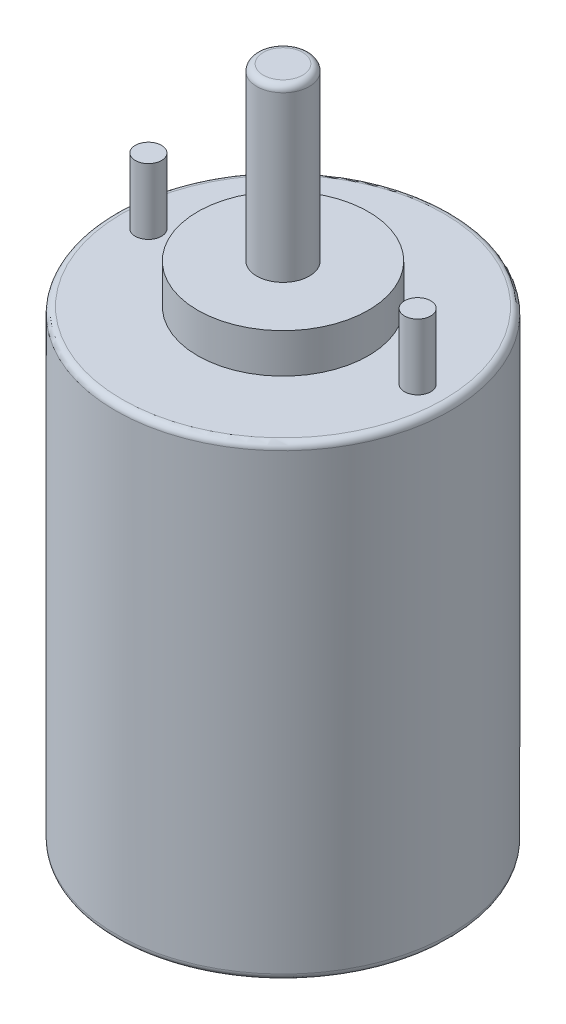
ISO-10303-21;
HEADER;
FILE_DESCRIPTION(('STEP AP214'),'2;1');
FILE_NAME('part.step','',(''),(''),'','','');
FILE_SCHEMA(('AUTOMOTIVE_DESIGN { 1 0 10303 214 1 1 1 1 }'));
ENDSEC;
DATA;
#1=APPLICATION_CONTEXT('core data for automotive mechanical design processes');
#2=APPLICATION_PROTOCOL_DEFINITION('international standard','automotive_design',2000,#1);
#3=PRODUCT_CONTEXT('',#1,'mechanical');
#4=PRODUCT('Part','Part','',(#3));
#5=PRODUCT_RELATED_PRODUCT_CATEGORY('part','',(#4));
#6=PRODUCT_DEFINITION_FORMATION('','',#4);
#7=PRODUCT_DEFINITION_CONTEXT('part definition',#1,'design');
#8=PRODUCT_DEFINITION('design','',#6,#7);
#9=PRODUCT_DEFINITION_SHAPE('','',#8);
#10=(LENGTH_UNIT() NAMED_UNIT(*) SI_UNIT(.MILLI.,.METRE.));
#11=(NAMED_UNIT(*) PLANE_ANGLE_UNIT() SI_UNIT($,.RADIAN.));
#12=(NAMED_UNIT(*) SI_UNIT($,.STERADIAN.) SOLID_ANGLE_UNIT());
#13=UNCERTAINTY_MEASURE_WITH_UNIT(LENGTH_MEASURE(1.E-05),#10,'distance_accuracy_value','');
#14=(GEOMETRIC_REPRESENTATION_CONTEXT(3) GLOBAL_UNCERTAINTY_ASSIGNED_CONTEXT((#13)) GLOBAL_UNIT_ASSIGNED_CONTEXT((#10,
#11,#12)) REPRESENTATION_CONTEXT('',''));
#15=CARTESIAN_POINT('',(0.,0.,0.));
#16=DIRECTION('',(0.,0.,1.));
#17=DIRECTION('',(1.,0.,0.));
#18=AXIS2_PLACEMENT_3D('',#15,#16,#17);
#19=CARTESIAN_POINT('',(0.,32.5,0.));
#20=DIRECTION('',(0.,-1.,0.));
#21=DIRECTION('',(0.,0.,-1.));
#22=AXIS2_PLACEMENT_3D('',#19,#20,#21);
#23=CYLINDRICAL_SURFACE('',#22,25.5);
#24=CARTESIAN_POINT('',(0.,-34.5,0.));
#25=DIRECTION('',(0.,-1.,0.));
#26=DIRECTION('',(0.,0.,-1.));
#27=AXIS2_PLACEMENT_3D('',#24,#25,#26);
#28=CIRCLE('',#27,25.5);
#29=CARTESIAN_POINT('',(0.,-34.5,-25.5));
#30=VERTEX_POINT('',#29);
#31=EDGE_CURVE('E66',#30,#30,#28,.F.);
#32=ORIENTED_EDGE('',*,*,#31,.T.);
#33=EDGE_LOOP('',(#32));
#34=FACE_BOUND('',#33,.T.);
#35=CARTESIAN_POINT('',(0.,34.5,0.));
#36=DIRECTION('',(0.,1.,0.));
#37=DIRECTION('',(0.,0.,1.));
#38=AXIS2_PLACEMENT_3D('',#35,#36,#37);
#39=CIRCLE('',#38,25.5);
#40=CARTESIAN_POINT('',(0.,34.5,25.5));
#41=VERTEX_POINT('',#40);
#42=EDGE_CURVE('E70',#41,#41,#39,.F.);
#43=ORIENTED_EDGE('',*,*,#42,.T.);
#44=EDGE_LOOP('',(#43));
#45=FACE_BOUND('',#44,.T.);
#46=ADVANCED_FACE('F38',(#34,#45),#23,.T.);
#47=CARTESIAN_POINT('',(0.,35.5,0.));
#48=DIRECTION('',(0.,1.,0.));
#49=DIRECTION('',(0.,0.,1.));
#50=AXIS2_PLACEMENT_3D('',#47,#48,#49);
#51=PLANE('',#50);
#52=CARTESIAN_POINT('',(20.5,35.5,0.));
#53=DIRECTION('',(0.,1.,0.));
#54=DIRECTION('',(0.,0.,1.));
#55=AXIS2_PLACEMENT_3D('',#52,#53,#54);
#56=CIRCLE('',#55,2.);
#57=CARTESIAN_POINT('',(20.5,35.5,2.));
#58=VERTEX_POINT('',#57);
#59=EDGE_CURVE('E99',#58,#58,#56,.T.);
#60=ORIENTED_EDGE('',*,*,#59,.F.);
#61=EDGE_LOOP('',(#60));
#62=FACE_BOUND('',#61,.T.);
#63=CARTESIAN_POINT('',(-20.5,35.5,0.));
#64=DIRECTION('',(0.,1.,0.));
#65=DIRECTION('',(0.,0.,1.));
#66=AXIS2_PLACEMENT_3D('',#63,#64,#65);
#67=CIRCLE('',#66,2.);
#68=CARTESIAN_POINT('',(-20.5,35.5,2.));
#69=VERTEX_POINT('',#68);
#70=EDGE_CURVE('E91',#69,#69,#67,.T.);
#71=ORIENTED_EDGE('',*,*,#70,.F.);
#72=EDGE_LOOP('',(#71));
#73=FACE_BOUND('',#72,.T.);
#74=CARTESIAN_POINT('',(0.,35.5,0.));
#75=DIRECTION('',(0.,1.,0.));
#76=DIRECTION('',(0.,0.,1.));
#77=AXIS2_PLACEMENT_3D('',#74,#75,#76);
#78=CIRCLE('',#77,13.);
#79=CARTESIAN_POINT('',(0.,35.5,13.));
#80=VERTEX_POINT('',#79);
#81=EDGE_CURVE('E79',#80,#80,#78,.T.);
#82=ORIENTED_EDGE('',*,*,#81,.F.);
#83=EDGE_LOOP('',(#82));
#84=FACE_BOUND('',#83,.T.);
#85=CARTESIAN_POINT('',(0.,35.5,0.));
#86=DIRECTION('',(0.,1.,0.));
#87=DIRECTION('',(0.,0.,1.));
#88=AXIS2_PLACEMENT_3D('',#85,#86,#87);
#89=CIRCLE('',#88,24.5);
#90=CARTESIAN_POINT('',(0.,35.5,24.5));
#91=VERTEX_POINT('',#90);
#92=EDGE_CURVE('E74',#91,#91,#89,.T.);
#93=ORIENTED_EDGE('',*,*,#92,.T.);
#94=EDGE_LOOP('',(#93));
#95=FACE_BOUND('',#94,.T.);
#96=ADVANCED_FACE('F116',(#62,#73,#84,#95),#51,.T.);
#97=CARTESIAN_POINT('',(0.,34.5,0.));
#98=DIRECTION('',(0.,1.,0.));
#99=DIRECTION('',(0.,0.,1.));
#100=AXIS2_PLACEMENT_3D('',#97,#98,#99);
#101=TOROIDAL_SURFACE('',#100,24.5,1.);
#102=ORIENTED_EDGE('',*,*,#42,.F.);
#103=EDGE_LOOP('',(#102));
#104=FACE_BOUND('',#103,.T.);
#105=ORIENTED_EDGE('',*,*,#92,.F.);
#106=EDGE_LOOP('',(#105));
#107=FACE_BOUND('',#106,.T.);
#108=ADVANCED_FACE('F119',(#104,#107),#101,.T.);
#109=CARTESIAN_POINT('',(0.,41.5,0.));
#110=DIRECTION('',(0.,-1.,0.));
#111=DIRECTION('',(0.,0.,-1.));
#112=AXIS2_PLACEMENT_3D('',#109,#110,#111);
#113=CYLINDRICAL_SURFACE('',#112,13.);
#114=CARTESIAN_POINT('',(0.,41.5,0.));
#115=DIRECTION('',(0.,1.,0.));
#116=DIRECTION('',(0.,0.,1.));
#117=AXIS2_PLACEMENT_3D('',#114,#115,#116);
#118=CIRCLE('',#117,13.);
#119=CARTESIAN_POINT('',(0.,41.5,13.));
#120=VERTEX_POINT('',#119);
#121=EDGE_CURVE('E78',#120,#120,#118,.T.);
#122=ORIENTED_EDGE('',*,*,#121,.F.);
#123=EDGE_LOOP('',(#122));
#124=FACE_BOUND('',#123,.T.);
#125=ORIENTED_EDGE('',*,*,#81,.T.);
#126=EDGE_LOOP('',(#125));
#127=FACE_BOUND('',#126,.T.);
#128=ADVANCED_FACE('F128',(#124,#127),#113,.T.);
#129=CARTESIAN_POINT('',(0.,41.5,0.));
#130=DIRECTION('',(0.,1.,0.));
#131=DIRECTION('',(0.,0.,1.));
#132=AXIS2_PLACEMENT_3D('',#129,#130,#131);
#133=PLANE('',#132);
#134=CARTESIAN_POINT('',(0.,41.5,0.));
#135=DIRECTION('',(0.,1.,0.));
#136=DIRECTION('',(0.,0.,1.));
#137=AXIS2_PLACEMENT_3D('',#134,#135,#136);
#138=CIRCLE('',#137,4.);
#139=CARTESIAN_POINT('',(0.,41.5,4.));
#140=VERTEX_POINT('',#139);
#141=EDGE_CURVE('E51',#140,#140,#138,.T.);
#142=ORIENTED_EDGE('',*,*,#141,.F.);
#143=EDGE_LOOP('',(#142));
#144=FACE_BOUND('',#143,.T.);
#145=ORIENTED_EDGE('',*,*,#121,.T.);
#146=EDGE_LOOP('',(#145));
#147=FACE_BOUND('',#146,.T.);
#148=ADVANCED_FACE('F134',(#144,#147),#133,.T.);
#149=CARTESIAN_POINT('',(0.,-35.5,0.));
#150=DIRECTION('',(0.,-1.,0.));
#151=DIRECTION('',(0.,0.,1.));
#152=AXIS2_PLACEMENT_3D('',#149,#150,#151);
#153=PLANE('',#152);
#154=CARTESIAN_POINT('',(0.,-35.5,0.));
#155=DIRECTION('',(0.,-1.,0.));
#156=DIRECTION('',(0.,0.,-1.));
#157=AXIS2_PLACEMENT_3D('',#154,#155,#156);
#158=CIRCLE('',#157,13.);
#159=CARTESIAN_POINT('',(0.,-35.5,-13.));
#160=VERTEX_POINT('',#159);
#161=EDGE_CURVE('E56',#160,#160,#158,.T.);
#162=ORIENTED_EDGE('',*,*,#161,.F.);
#163=EDGE_LOOP('',(#162));
#164=FACE_BOUND('',#163,.T.);
#165=CARTESIAN_POINT('',(0.,-35.5,0.));
#166=DIRECTION('',(0.,-1.,0.));
#167=DIRECTION('',(0.,0.,-1.));
#168=AXIS2_PLACEMENT_3D('',#165,#166,#167);
#169=CIRCLE('',#168,24.5);
#170=CARTESIAN_POINT('',(0.,-35.5,-24.5));
#171=VERTEX_POINT('',#170);
#172=EDGE_CURVE('E62',#171,#171,#169,.T.);
#173=ORIENTED_EDGE('',*,*,#172,.T.);
#174=EDGE_LOOP('',(#173));
#175=FACE_BOUND('',#174,.T.);
#176=ADVANCED_FACE('F147',(#164,#175),#153,.T.);
#177=CARTESIAN_POINT('',(0.,-34.5,0.));
#178=DIRECTION('',(0.,-1.,0.));
#179=DIRECTION('',(0.,0.,-1.));
#180=AXIS2_PLACEMENT_3D('',#177,#178,#179);
#181=TOROIDAL_SURFACE('',#180,24.5,1.);
#182=ORIENTED_EDGE('',*,*,#172,.F.);
#183=EDGE_LOOP('',(#182));
#184=FACE_BOUND('',#183,.T.);
#185=ORIENTED_EDGE('',*,*,#31,.F.);
#186=EDGE_LOOP('',(#185));
#187=FACE_BOUND('',#186,.T.);
#188=ADVANCED_FACE('F151',(#184,#187),#181,.T.);
#189=CARTESIAN_POINT('',(0.,-41.5,0.));
#190=DIRECTION('',(0.,1.,0.));
#191=DIRECTION('',(0.,0.,1.));
#192=AXIS2_PLACEMENT_3D('',#189,#190,#191);
#193=CYLINDRICAL_SURFACE('',#192,13.);
#194=CARTESIAN_POINT('',(0.,-41.5,0.));
#195=DIRECTION('',(0.,1.,0.));
#196=DIRECTION('',(0.,0.,1.));
#197=AXIS2_PLACEMENT_3D('',#194,#195,#196);
#198=CIRCLE('',#197,13.);
#199=CARTESIAN_POINT('',(0.,-41.5,13.));
#200=VERTEX_POINT('',#199);
#201=EDGE_CURVE('E83',#200,#200,#198,.T.);
#202=ORIENTED_EDGE('',*,*,#201,.T.);
#203=EDGE_LOOP('',(#202));
#204=FACE_BOUND('',#203,.T.);
#205=ORIENTED_EDGE('',*,*,#161,.T.);
#206=EDGE_LOOP('',(#205));
#207=FACE_BOUND('',#206,.T.);
#208=ADVANCED_FACE('F153',(#204,#207),#193,.T.);
#209=CARTESIAN_POINT('',(0.,-41.5,0.));
#210=DIRECTION('',(0.,-1.,0.));
#211=DIRECTION('',(0.,0.,1.));
#212=AXIS2_PLACEMENT_3D('',#209,#210,#211);
#213=PLANE('',#212);
#214=ORIENTED_EDGE('',*,*,#201,.F.);
#215=EDGE_LOOP('',(#214));
#216=FACE_BOUND('',#215,.T.);
#217=ADVANCED_FACE('F156',(#216),#213,.T.);
#218=CARTESIAN_POINT('',(0.,67.5,0.));
#219=DIRECTION('',(0.,-1.,0.));
#220=DIRECTION('',(0.,0.,-1.));
#221=AXIS2_PLACEMENT_3D('',#218,#219,#220);
#222=CYLINDRICAL_SURFACE('',#221,4.);
#223=CARTESIAN_POINT('',(0.,66.5,0.));
#224=DIRECTION('',(0.,1.,0.));
#225=DIRECTION('',(0.,0.,1.));
#226=AXIS2_PLACEMENT_3D('',#223,#224,#225);
#227=CIRCLE('',#226,4.);
#228=CARTESIAN_POINT('',(0.,66.5,4.));
#229=VERTEX_POINT('',#228);
#230=EDGE_CURVE('E10',#229,#229,#227,.F.);
#231=ORIENTED_EDGE('',*,*,#230,.T.);
#232=EDGE_LOOP('',(#231));
#233=FACE_BOUND('',#232,.T.);
#234=ORIENTED_EDGE('',*,*,#141,.T.);
#235=EDGE_LOOP('',(#234));
#236=FACE_BOUND('',#235,.T.);
#237=ADVANCED_FACE('F160',(#233,#236),#222,.T.);
#238=CARTESIAN_POINT('',(0.,67.5,0.));
#239=DIRECTION('',(0.,1.,0.));
#240=DIRECTION('',(0.,0.,1.));
#241=AXIS2_PLACEMENT_3D('',#238,#239,#240);
#242=PLANE('',#241);
#243=CARTESIAN_POINT('',(0.,67.5,0.));
#244=DIRECTION('',(0.,1.,0.));
#245=DIRECTION('',(0.,0.,1.));
#246=AXIS2_PLACEMENT_3D('',#243,#244,#245);
#247=CIRCLE('',#246,3.);
#248=CARTESIAN_POINT('',(0.,67.5,3.));
#249=VERTEX_POINT('',#248);
#250=EDGE_CURVE('E46',#249,#249,#247,.T.);
#251=ORIENTED_EDGE('',*,*,#250,.T.);
#252=EDGE_LOOP('',(#251));
#253=FACE_BOUND('',#252,.T.);
#254=ADVANCED_FACE('F164',(#253),#242,.T.);
#255=CARTESIAN_POINT('',(-20.5,45.5,0.));
#256=DIRECTION('',(0.,-1.,0.));
#257=DIRECTION('',(0.,0.,-1.));
#258=AXIS2_PLACEMENT_3D('',#255,#256,#257);
#259=CYLINDRICAL_SURFACE('',#258,2.);
#260=CARTESIAN_POINT('',(-20.5,45.5,0.));
#261=DIRECTION('',(0.,1.,0.));
#262=DIRECTION('',(0.,0.,1.));
#263=AXIS2_PLACEMENT_3D('',#260,#261,#262);
#264=CIRCLE('',#263,2.);
#265=CARTESIAN_POINT('',(-20.5,45.5,2.));
#266=VERTEX_POINT('',#265);
#267=EDGE_CURVE('E89',#266,#266,#264,.T.);
#268=ORIENTED_EDGE('',*,*,#267,.F.);
#269=EDGE_LOOP('',(#268));
#270=FACE_BOUND('',#269,.T.);
#271=ORIENTED_EDGE('',*,*,#70,.T.);
#272=EDGE_LOOP('',(#271));
#273=FACE_BOUND('',#272,.T.);
#274=ADVANCED_FACE('F167',(#270,#273),#259,.T.);
#275=CARTESIAN_POINT('',(-20.5,45.5,0.));
#276=DIRECTION('',(0.,1.,0.));
#277=DIRECTION('',(0.,0.,1.));
#278=AXIS2_PLACEMENT_3D('',#275,#276,#277);
#279=PLANE('',#278);
#280=ORIENTED_EDGE('',*,*,#267,.T.);
#281=EDGE_LOOP('',(#280));
#282=FACE_BOUND('',#281,.T.);
#283=ADVANCED_FACE('F112',(#282),#279,.T.);
#284=CARTESIAN_POINT('',(20.5,45.5,0.));
#285=DIRECTION('',(0.,-1.,0.));
#286=DIRECTION('',(0.,0.,-1.));
#287=AXIS2_PLACEMENT_3D('',#284,#285,#286);
#288=CYLINDRICAL_SURFACE('',#287,2.);
#289=CARTESIAN_POINT('',(20.5,45.5,0.));
#290=DIRECTION('',(0.,1.,0.));
#291=DIRECTION('',(0.,0.,1.));
#292=AXIS2_PLACEMENT_3D('',#289,#290,#291);
#293=CIRCLE('',#292,2.);
#294=CARTESIAN_POINT('',(20.5,45.5,2.));
#295=VERTEX_POINT('',#294);
#296=EDGE_CURVE('E95',#295,#295,#293,.T.);
#297=ORIENTED_EDGE('',*,*,#296,.F.);
#298=EDGE_LOOP('',(#297));
#299=FACE_BOUND('',#298,.T.);
#300=ORIENTED_EDGE('',*,*,#59,.T.);
#301=EDGE_LOOP('',(#300));
#302=FACE_BOUND('',#301,.T.);
#303=ADVANCED_FACE('F109',(#299,#302),#288,.T.);
#304=CARTESIAN_POINT('',(20.5,45.5,0.));
#305=DIRECTION('',(0.,1.,0.));
#306=DIRECTION('',(0.,0.,1.));
#307=AXIS2_PLACEMENT_3D('',#304,#305,#306);
#308=PLANE('',#307);
#309=ORIENTED_EDGE('',*,*,#296,.T.);
#310=EDGE_LOOP('',(#309));
#311=FACE_BOUND('',#310,.T.);
#312=ADVANCED_FACE('F107',(#311),#308,.T.);
#313=CARTESIAN_POINT('',(0.,66.5,0.));
#314=DIRECTION('',(0.,1.,0.));
#315=DIRECTION('',(0.,0.,1.));
#316=AXIS2_PLACEMENT_3D('',#313,#314,#315);
#317=TOROIDAL_SURFACE('',#316,3.,1.);
#318=ORIENTED_EDGE('',*,*,#230,.F.);
#319=EDGE_LOOP('',(#318));
#320=FACE_BOUND('',#319,.T.);
#321=ORIENTED_EDGE('',*,*,#250,.F.);
#322=EDGE_LOOP('',(#321));
#323=FACE_BOUND('',#322,.T.);
#324=ADVANCED_FACE('F40',(#320,#323),#317,.T.);
#325=CLOSED_SHELL('',(#46,#96,#108,#128,#148,#176,#188,#208,#217,#237,#254,#274,#283,#303,#312,#324));
#326=MANIFOLD_SOLID_BREP('B2',#325);
#327=ADVANCED_BREP_SHAPE_REPRESENTATION('',(#18,#326),#14);
#328=SHAPE_DEFINITION_REPRESENTATION(#9,#327);
ENDSEC;
END-ISO-10303-21;
